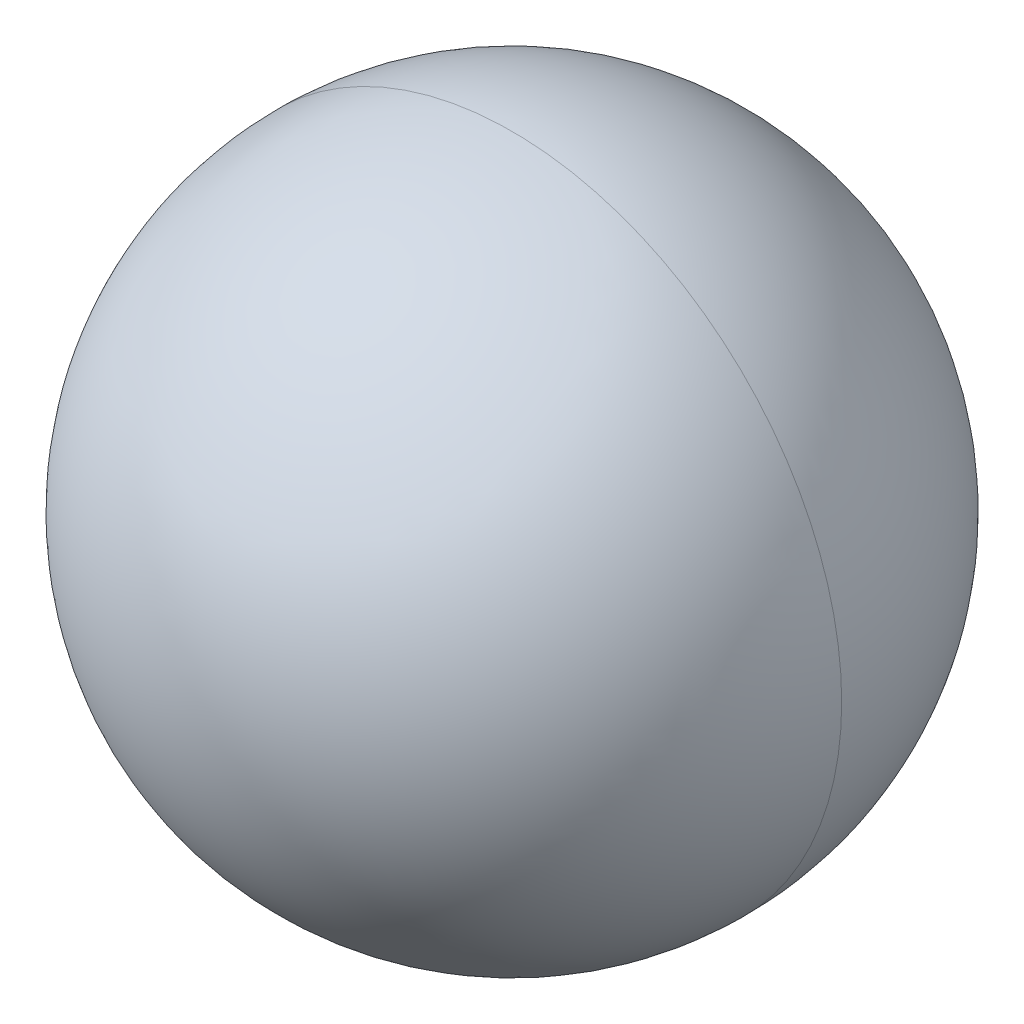
ISO-10303-21;
HEADER;
FILE_DESCRIPTION(('STEP AP214'),'2;1');
FILE_NAME('part.step','',(''),(''),'','','');
FILE_SCHEMA(('AUTOMOTIVE_DESIGN { 1 0 10303 214 1 1 1 1 }'));
ENDSEC;
DATA;
#1=APPLICATION_CONTEXT('core data for automotive mechanical design processes');
#2=APPLICATION_PROTOCOL_DEFINITION('international standard','automotive_design',2000,#1);
#3=PRODUCT_CONTEXT('',#1,'mechanical');
#4=PRODUCT('Part','Part','',(#3));
#5=PRODUCT_RELATED_PRODUCT_CATEGORY('part','',(#4));
#6=PRODUCT_DEFINITION_FORMATION('','',#4);
#7=PRODUCT_DEFINITION_CONTEXT('part definition',#1,'design');
#8=PRODUCT_DEFINITION('design','',#6,#7);
#9=PRODUCT_DEFINITION_SHAPE('','',#8);
#10=(LENGTH_UNIT() NAMED_UNIT(*) SI_UNIT(.MILLI.,.METRE.));
#11=(NAMED_UNIT(*) PLANE_ANGLE_UNIT() SI_UNIT($,.RADIAN.));
#12=(NAMED_UNIT(*) SI_UNIT($,.STERADIAN.) SOLID_ANGLE_UNIT());
#13=UNCERTAINTY_MEASURE_WITH_UNIT(LENGTH_MEASURE(1.E-05),#10,'distance_accuracy_value','');
#14=(GEOMETRIC_REPRESENTATION_CONTEXT(3) GLOBAL_UNCERTAINTY_ASSIGNED_CONTEXT((#13)) GLOBAL_UNIT_ASSIGNED_CONTEXT((#10,
#11,#12)) REPRESENTATION_CONTEXT('',''));
#15=CARTESIAN_POINT('',(0.,0.,0.));
#16=DIRECTION('',(0.,0.,1.));
#17=DIRECTION('',(1.,0.,0.));
#18=AXIS2_PLACEMENT_3D('',#15,#16,#17);
#19=CARTESIAN_POINT('',(2.5,7.25,0.));
#20=DIRECTION('',(1.,0.,0.));
#21=DIRECTION('',(0.,0.,1.));
#22=AXIS2_PLACEMENT_3D('',#19,#20,#21);
#23=SPHERICAL_SURFACE('',#22,1.1905);
#24=CARTESIAN_POINT('',(2.5,7.25,0.));
#25=DIRECTION('',(0.,0.,-1.));
#26=DIRECTION('',(1.,0.,0.));
#27=AXIS2_PLACEMENT_3D('',#24,#25,#26);
#28=CIRCLE('',#27,1.1905);
#29=CARTESIAN_POINT('',(3.6905,7.25,0.));
#30=VERTEX_POINT('',#29);
#31=CARTESIAN_POINT('',(1.3095,7.25,0.));
#32=VERTEX_POINT('',#31);
#33=EDGE_CURVE('E11',#30,#32,#28,.T.);
#34=ORIENTED_EDGE('',*,*,#33,.T.);
#35=CARTESIAN_POINT('',(2.5,7.25,0.));
#36=DIRECTION('',(0.,0.,1.));
#37=DIRECTION('',(1.,0.,0.));
#38=AXIS2_PLACEMENT_3D('',#35,#36,#37);
#39=CIRCLE('',#38,1.1905);
#40=EDGE_CURVE('E24',#30,#32,#39,.T.);
#41=ORIENTED_EDGE('',*,*,#40,.F.);
#42=EDGE_LOOP('',(#34,#41));
#43=FACE_BOUND('',#42,.T.);
#44=ADVANCED_FACE('F16',(#43),#23,.T.);
#45=CARTESIAN_POINT('',(2.5,7.25,0.));
#46=DIRECTION('',(1.,0.,0.));
#47=DIRECTION('',(0.,0.,-1.));
#48=AXIS2_PLACEMENT_3D('',#45,#46,#47);
#49=SPHERICAL_SURFACE('',#48,1.1905);
#50=ORIENTED_EDGE('',*,*,#33,.F.);
#51=ORIENTED_EDGE('',*,*,#40,.T.);
#52=EDGE_LOOP('',(#50,#51));
#53=FACE_BOUND('',#52,.T.);
#54=ADVANCED_FACE('F32',(#53),#49,.T.);
#55=CLOSED_SHELL('',(#44,#54));
#56=MANIFOLD_SOLID_BREP('B1',#55);
#57=ADVANCED_BREP_SHAPE_REPRESENTATION('',(#18,#56),#14);
#58=SHAPE_DEFINITION_REPRESENTATION(#9,#57);
ENDSEC;
END-ISO-10303-21;
